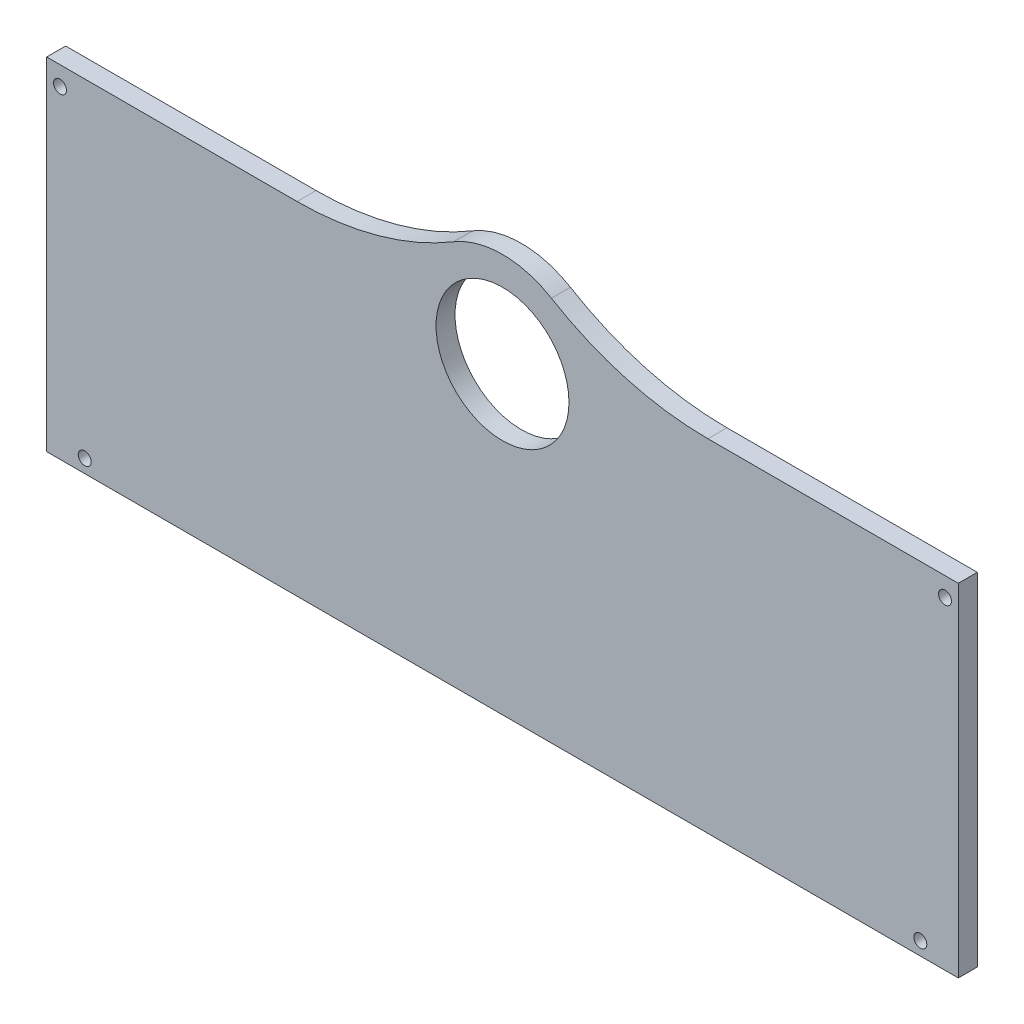
ISO-10303-21;
HEADER;
FILE_DESCRIPTION(('STEP AP214'),'2;1');
FILE_NAME('part.step','',(''),(''),'','','');
FILE_SCHEMA(('AUTOMOTIVE_DESIGN { 1 0 10303 214 1 1 1 1 }'));
ENDSEC;
DATA;
#1=APPLICATION_CONTEXT('core data for automotive mechanical design processes');
#2=APPLICATION_PROTOCOL_DEFINITION('international standard','automotive_design',2000,#1);
#3=PRODUCT_CONTEXT('',#1,'mechanical');
#4=PRODUCT('Part','Part','',(#3));
#5=PRODUCT_RELATED_PRODUCT_CATEGORY('part','',(#4));
#6=PRODUCT_DEFINITION_FORMATION('','',#4);
#7=PRODUCT_DEFINITION_CONTEXT('part definition',#1,'design');
#8=PRODUCT_DEFINITION('design','',#6,#7);
#9=PRODUCT_DEFINITION_SHAPE('','',#8);
#10=(LENGTH_UNIT() NAMED_UNIT(*) SI_UNIT(.MILLI.,.METRE.));
#11=(NAMED_UNIT(*) PLANE_ANGLE_UNIT() SI_UNIT($,.RADIAN.));
#12=(NAMED_UNIT(*) SI_UNIT($,.STERADIAN.) SOLID_ANGLE_UNIT());
#13=UNCERTAINTY_MEASURE_WITH_UNIT(LENGTH_MEASURE(1.E-05),#10,'distance_accuracy_value','');
#14=(GEOMETRIC_REPRESENTATION_CONTEXT(3) GLOBAL_UNCERTAINTY_ASSIGNED_CONTEXT((#13)) GLOBAL_UNIT_ASSIGNED_CONTEXT((#10,
#11,#12)) REPRESENTATION_CONTEXT('',''));
#15=CARTESIAN_POINT('',(0.,0.,0.));
#16=DIRECTION('',(0.,0.,1.));
#17=DIRECTION('',(1.,0.,0.));
#18=AXIS2_PLACEMENT_3D('',#15,#16,#17);
#19=CARTESIAN_POINT('',(-68.685751797589,114.3,6.35));
#20=DIRECTION('',(0.,0.,1.));
#21=DIRECTION('',(1.,0.,0.));
#22=AXIS2_PLACEMENT_3D('',#19,#20,#21);
#23=PLANE('',#22);
#24=CARTESIAN_POINT('',(139.7,-97.155,6.35));
#25=DIRECTION('',(0.,0.,1.));
#26=DIRECTION('',(1.,0.,0.));
#27=AXIS2_PLACEMENT_3D('',#24,#25,#26);
#28=CIRCLE('',#27,2.15899999999999);
#29=CARTESIAN_POINT('',(141.859,-97.155,6.35));
#30=VERTEX_POINT('',#29);
#31=EDGE_CURVE('E227',#30,#30,#28,.T.);
#32=ORIENTED_EDGE('',*,*,#31,.F.);
#33=EDGE_LOOP('',(#32));
#34=FACE_BOUND('',#33,.T.);
#35=CARTESIAN_POINT('',(147.955,6.34999999999999,6.35));
#36=DIRECTION('',(0.,0.,1.));
#37=DIRECTION('',(1.,0.,0.));
#38=AXIS2_PLACEMENT_3D('',#35,#36,#37);
#39=CIRCLE('',#38,2.15899999999999);
#40=CARTESIAN_POINT('',(150.114,6.34999999999999,6.35));
#41=VERTEX_POINT('',#40);
#42=EDGE_CURVE('E235',#41,#41,#39,.T.);
#43=ORIENTED_EDGE('',*,*,#42,.F.);
#44=EDGE_LOOP('',(#43));
#45=FACE_BOUND('',#44,.T.);
#46=CARTESIAN_POINT('',(-147.955,6.34999999999999,6.35));
#47=DIRECTION('',(0.,0.,1.));
#48=DIRECTION('',(1.,0.,0.));
#49=AXIS2_PLACEMENT_3D('',#46,#47,#48);
#50=CIRCLE('',#49,2.15899999999999);
#51=CARTESIAN_POINT('',(-145.796,6.34999999999999,6.35));
#52=VERTEX_POINT('',#51);
#53=EDGE_CURVE('E243',#52,#52,#50,.T.);
#54=ORIENTED_EDGE('',*,*,#53,.F.);
#55=EDGE_LOOP('',(#54));
#56=FACE_BOUND('',#55,.T.);
#57=CARTESIAN_POINT('',(-139.7,-97.155,6.35));
#58=DIRECTION('',(0.,0.,1.));
#59=DIRECTION('',(1.,0.,0.));
#60=AXIS2_PLACEMENT_3D('',#57,#58,#59);
#61=CIRCLE('',#60,2.15899999999999);
#62=CARTESIAN_POINT('',(-137.541,-97.155,6.35));
#63=VERTEX_POINT('',#62);
#64=EDGE_CURVE('E219',#63,#63,#61,.T.);
#65=ORIENTED_EDGE('',*,*,#64,.F.);
#66=EDGE_LOOP('',(#65));
#67=FACE_BOUND('',#66,.T.);
#68=DIRECTION('',(0.,-1.,0.));
#69=VECTOR('',#68,1.);
#70=CARTESIAN_POINT('',(-152.4,-101.6,6.35));
#71=LINE('',#70,#69);
#72=CARTESIAN_POINT('',(-152.4,12.7,6.35));
#73=VERTEX_POINT('',#72);
#74=CARTESIAN_POINT('',(-152.4,-101.6,6.35));
#75=VERTEX_POINT('',#74);
#76=EDGE_CURVE('E166',#73,#75,#71,.T.);
#77=ORIENTED_EDGE('',*,*,#76,.T.);
#78=DIRECTION('',(1.,0.,0.));
#79=VECTOR('',#78,1.);
#80=CARTESIAN_POINT('',(-152.4,-101.6,6.35));
#81=LINE('',#80,#79);
#82=CARTESIAN_POINT('',(152.4,-101.6,6.35));
#83=VERTEX_POINT('',#82);
#84=EDGE_CURVE('E102',#75,#83,#81,.T.);
#85=ORIENTED_EDGE('',*,*,#84,.T.);
#86=DIRECTION('',(0.,1.,0.));
#87=VECTOR('',#86,1.);
#88=CARTESIAN_POINT('',(152.4,-101.6,6.35));
#89=LINE('',#88,#87);
#90=CARTESIAN_POINT('',(152.4,12.7,6.35));
#91=VERTEX_POINT('',#90);
#92=EDGE_CURVE('E187',#83,#91,#89,.T.);
#93=ORIENTED_EDGE('',*,*,#92,.T.);
#94=DIRECTION('',(-1.,0.,0.));
#95=VECTOR('',#94,1.);
#96=CARTESIAN_POINT('',(152.4,12.7,6.35));
#97=LINE('',#96,#95);
#98=CARTESIAN_POINT('',(68.685751797589,12.7,6.35));
#99=VERTEX_POINT('',#98);
#100=EDGE_CURVE('E201',#91,#99,#97,.T.);
#101=ORIENTED_EDGE('',*,*,#100,.T.);
#102=CARTESIAN_POINT('',(68.685751797589,114.3,6.35));
#103=DIRECTION('',(0.,0.,-1.));
#104=DIRECTION('',(-1.,0.,0.));
#105=AXIS2_PLACEMENT_3D('',#102,#103,#104);
#106=CIRCLE('',#105,101.6);
#107=CARTESIAN_POINT('',(16.3537504279974,27.2142857142857,6.35));
#108=VERTEX_POINT('',#107);
#109=EDGE_CURVE('E121',#99,#108,#106,.T.);
#110=ORIENTED_EDGE('',*,*,#109,.T.);
#111=CARTESIAN_POINT('',(0.,0.,6.35));
#112=DIRECTION('',(0.,0.,1.));
#113=DIRECTION('',(-1.,0.,0.));
#114=AXIS2_PLACEMENT_3D('',#111,#112,#113);
#115=CIRCLE('',#114,31.75);
#116=CARTESIAN_POINT('',(-16.3537504279974,27.2142857142857,6.35));
#117=VERTEX_POINT('',#116);
#118=EDGE_CURVE('E115',#108,#117,#115,.T.);
#119=ORIENTED_EDGE('',*,*,#118,.T.);
#120=CARTESIAN_POINT('',(-68.685751797589,114.3,6.35));
#121=DIRECTION('',(0.,0.,-1.));
#122=DIRECTION('',(1.,0.,0.));
#123=AXIS2_PLACEMENT_3D('',#120,#121,#122);
#124=CIRCLE('',#123,101.6);
#125=CARTESIAN_POINT('',(-68.685751797589,12.7,6.35));
#126=VERTEX_POINT('',#125);
#127=EDGE_CURVE('E119',#117,#126,#124,.T.);
#128=ORIENTED_EDGE('',*,*,#127,.T.);
#129=DIRECTION('',(-1.,0.,0.));
#130=VECTOR('',#129,1.);
#131=CARTESIAN_POINT('',(-152.4,12.7,6.35));
#132=LINE('',#131,#130);
#133=EDGE_CURVE('E59',#126,#73,#132,.T.);
#134=ORIENTED_EDGE('',*,*,#133,.T.);
#135=EDGE_LOOP('',(#77,#85,#93,#101,#110,#119,#128,#134));
#136=FACE_BOUND('',#135,.T.);
#137=CARTESIAN_POINT('',(0.,0.,6.35));
#138=DIRECTION('',(0.,0.,1.));
#139=DIRECTION('',(1.,0.,0.));
#140=AXIS2_PLACEMENT_3D('',#137,#138,#139);
#141=CIRCLE('',#140,22.225);
#142=CARTESIAN_POINT('',(22.225,0.,6.35));
#143=VERTEX_POINT('',#142);
#144=EDGE_CURVE('E148',#143,#143,#141,.T.);
#145=ORIENTED_EDGE('',*,*,#144,.F.);
#146=EDGE_LOOP('',(#145));
#147=FACE_BOUND('',#146,.T.);
#148=ADVANCED_FACE('F41',(#34,#45,#56,#67,#136,#147),#23,.T.);
#149=CARTESIAN_POINT('',(-68.685751797589,114.3,0.));
#150=DIRECTION('',(0.,0.,1.));
#151=DIRECTION('',(1.,0.,0.));
#152=AXIS2_PLACEMENT_3D('',#149,#150,#151);
#153=PLANE('',#152);
#154=CARTESIAN_POINT('',(139.7,-97.155,0.));
#155=DIRECTION('',(0.,0.,1.));
#156=DIRECTION('',(1.,0.,0.));
#157=AXIS2_PLACEMENT_3D('',#154,#155,#156);
#158=CIRCLE('',#157,2.15899999999999);
#159=CARTESIAN_POINT('',(141.859,-97.155,0.));
#160=VERTEX_POINT('',#159);
#161=EDGE_CURVE('E231',#160,#160,#158,.T.);
#162=ORIENTED_EDGE('',*,*,#161,.T.);
#163=EDGE_LOOP('',(#162));
#164=FACE_BOUND('',#163,.T.);
#165=CARTESIAN_POINT('',(147.955,6.34999999999999,0.));
#166=DIRECTION('',(0.,0.,1.));
#167=DIRECTION('',(1.,0.,0.));
#168=AXIS2_PLACEMENT_3D('',#165,#166,#167);
#169=CIRCLE('',#168,2.15899999999999);
#170=CARTESIAN_POINT('',(150.114,6.34999999999999,0.));
#171=VERTEX_POINT('',#170);
#172=EDGE_CURVE('E239',#171,#171,#169,.T.);
#173=ORIENTED_EDGE('',*,*,#172,.T.);
#174=EDGE_LOOP('',(#173));
#175=FACE_BOUND('',#174,.T.);
#176=CARTESIAN_POINT('',(-147.955,6.34999999999999,0.));
#177=DIRECTION('',(0.,0.,1.));
#178=DIRECTION('',(1.,0.,0.));
#179=AXIS2_PLACEMENT_3D('',#176,#177,#178);
#180=CIRCLE('',#179,2.15899999999999);
#181=CARTESIAN_POINT('',(-145.796,6.34999999999999,0.));
#182=VERTEX_POINT('',#181);
#183=EDGE_CURVE('E223',#182,#182,#180,.T.);
#184=ORIENTED_EDGE('',*,*,#183,.T.);
#185=EDGE_LOOP('',(#184));
#186=FACE_BOUND('',#185,.T.);
#187=CARTESIAN_POINT('',(-139.7,-97.155,0.));
#188=DIRECTION('',(0.,0.,1.));
#189=DIRECTION('',(1.,0.,0.));
#190=AXIS2_PLACEMENT_3D('',#187,#188,#189);
#191=CIRCLE('',#190,2.15899999999999);
#192=CARTESIAN_POINT('',(-137.541,-97.155,0.));
#193=VERTEX_POINT('',#192);
#194=EDGE_CURVE('E215',#193,#193,#191,.T.);
#195=ORIENTED_EDGE('',*,*,#194,.T.);
#196=EDGE_LOOP('',(#195));
#197=FACE_BOUND('',#196,.T.);
#198=DIRECTION('',(0.,-1.,0.));
#199=VECTOR('',#198,1.);
#200=CARTESIAN_POINT('',(-152.4,-101.6,0.));
#201=LINE('',#200,#199);
#202=CARTESIAN_POINT('',(-152.4,12.7,0.));
#203=VERTEX_POINT('',#202);
#204=CARTESIAN_POINT('',(-152.4,-101.6,0.));
#205=VERTEX_POINT('',#204);
#206=EDGE_CURVE('E143',#203,#205,#201,.T.);
#207=ORIENTED_EDGE('',*,*,#206,.F.);
#208=DIRECTION('',(-1.,0.,0.));
#209=VECTOR('',#208,1.);
#210=CARTESIAN_POINT('',(-152.4,12.7,0.));
#211=LINE('',#210,#209);
#212=CARTESIAN_POINT('',(-68.685751797589,12.7,0.));
#213=VERTEX_POINT('',#212);
#214=EDGE_CURVE('E94',#213,#203,#211,.T.);
#215=ORIENTED_EDGE('',*,*,#214,.F.);
#216=CARTESIAN_POINT('',(-68.685751797589,114.3,0.));
#217=DIRECTION('',(0.,0.,-1.));
#218=DIRECTION('',(1.,0.,0.));
#219=AXIS2_PLACEMENT_3D('',#216,#217,#218);
#220=CIRCLE('',#219,101.6);
#221=CARTESIAN_POINT('',(-16.3537504279974,27.2142857142857,0.));
#222=VERTEX_POINT('',#221);
#223=EDGE_CURVE('E88',#222,#213,#220,.T.);
#224=ORIENTED_EDGE('',*,*,#223,.F.);
#225=CARTESIAN_POINT('',(0.,0.,0.));
#226=DIRECTION('',(0.,0.,1.));
#227=DIRECTION('',(-1.,0.,0.));
#228=AXIS2_PLACEMENT_3D('',#225,#226,#227);
#229=CIRCLE('',#228,31.75);
#230=CARTESIAN_POINT('',(16.3537504279974,27.2142857142857,0.));
#231=VERTEX_POINT('',#230);
#232=EDGE_CURVE('E130',#231,#222,#229,.T.);
#233=ORIENTED_EDGE('',*,*,#232,.F.);
#234=CARTESIAN_POINT('',(68.685751797589,114.3,0.));
#235=DIRECTION('',(0.,0.,-1.));
#236=DIRECTION('',(-1.,0.,0.));
#237=AXIS2_PLACEMENT_3D('',#234,#235,#236);
#238=CIRCLE('',#237,101.6);
#239=CARTESIAN_POINT('',(68.685751797589,12.7,0.));
#240=VERTEX_POINT('',#239);
#241=EDGE_CURVE('E157',#240,#231,#238,.T.);
#242=ORIENTED_EDGE('',*,*,#241,.F.);
#243=DIRECTION('',(-1.,0.,0.));
#244=VECTOR('',#243,1.);
#245=CARTESIAN_POINT('',(152.4,12.7,0.));
#246=LINE('',#245,#244);
#247=CARTESIAN_POINT('',(152.4,12.7,0.));
#248=VERTEX_POINT('',#247);
#249=EDGE_CURVE('E154',#248,#240,#246,.T.);
#250=ORIENTED_EDGE('',*,*,#249,.F.);
#251=DIRECTION('',(0.,1.,0.));
#252=VECTOR('',#251,1.);
#253=CARTESIAN_POINT('',(152.4,-101.6,0.));
#254=LINE('',#253,#252);
#255=CARTESIAN_POINT('',(152.4,-101.6,0.));
#256=VERTEX_POINT('',#255);
#257=EDGE_CURVE('E151',#256,#248,#254,.T.);
#258=ORIENTED_EDGE('',*,*,#257,.F.);
#259=DIRECTION('',(1.,0.,0.));
#260=VECTOR('',#259,1.);
#261=CARTESIAN_POINT('',(-152.4,-101.6,0.));
#262=LINE('',#261,#260);
#263=EDGE_CURVE('E147',#205,#256,#262,.T.);
#264=ORIENTED_EDGE('',*,*,#263,.F.);
#265=EDGE_LOOP('',(#207,#215,#224,#233,#242,#250,#258,#264));
#266=FACE_BOUND('',#265,.T.);
#267=CARTESIAN_POINT('',(0.,0.,0.));
#268=DIRECTION('',(0.,0.,1.));
#269=DIRECTION('',(1.,0.,0.));
#270=AXIS2_PLACEMENT_3D('',#267,#268,#269);
#271=CIRCLE('',#270,22.225);
#272=CARTESIAN_POINT('',(22.225,0.,0.));
#273=VERTEX_POINT('',#272);
#274=EDGE_CURVE('E211',#273,#273,#271,.T.);
#275=ORIENTED_EDGE('',*,*,#274,.T.);
#276=EDGE_LOOP('',(#275));
#277=FACE_BOUND('',#276,.T.);
#278=ADVANCED_FACE('F191',(#164,#175,#186,#197,#266,#277),#153,.F.);
#279=CARTESIAN_POINT('',(-152.4,-101.6,6.35));
#280=DIRECTION('',(1.,0.,0.));
#281=DIRECTION('',(0.,0.,-1.));
#282=AXIS2_PLACEMENT_3D('',#279,#280,#281);
#283=PLANE('',#282);
#284=ORIENTED_EDGE('',*,*,#206,.T.);
#285=DIRECTION('',(0.,0.,-1.));
#286=VECTOR('',#285,1.);
#287=CARTESIAN_POINT('',(-152.4,-101.6,6.35));
#288=LINE('',#287,#286);
#289=EDGE_CURVE('E11',#75,#205,#288,.T.);
#290=ORIENTED_EDGE('',*,*,#289,.F.);
#291=ORIENTED_EDGE('',*,*,#76,.F.);
#292=DIRECTION('',(0.,0.,-1.));
#293=VECTOR('',#292,1.);
#294=CARTESIAN_POINT('',(-152.4,12.7,6.35));
#295=LINE('',#294,#293);
#296=EDGE_CURVE('E139',#73,#203,#295,.T.);
#297=ORIENTED_EDGE('',*,*,#296,.T.);
#298=EDGE_LOOP('',(#284,#290,#291,#297));
#299=FACE_BOUND('',#298,.T.);
#300=ADVANCED_FACE('F43',(#299),#283,.F.);
#301=CARTESIAN_POINT('',(-152.4,-101.6,6.35));
#302=DIRECTION('',(0.,1.,0.));
#303=DIRECTION('',(0.,0.,1.));
#304=AXIS2_PLACEMENT_3D('',#301,#302,#303);
#305=PLANE('',#304);
#306=ORIENTED_EDGE('',*,*,#263,.T.);
#307=DIRECTION('',(0.,0.,-1.));
#308=VECTOR('',#307,1.);
#309=CARTESIAN_POINT('',(152.4,-101.6,6.35));
#310=LINE('',#309,#308);
#311=EDGE_CURVE('E51',#83,#256,#310,.T.);
#312=ORIENTED_EDGE('',*,*,#311,.F.);
#313=ORIENTED_EDGE('',*,*,#84,.F.);
#314=ORIENTED_EDGE('',*,*,#289,.T.);
#315=EDGE_LOOP('',(#306,#312,#313,#314));
#316=FACE_BOUND('',#315,.T.);
#317=ADVANCED_FACE('F296',(#316),#305,.F.);
#318=CARTESIAN_POINT('',(152.4,-101.6,6.35));
#319=DIRECTION('',(-1.,0.,0.));
#320=DIRECTION('',(0.,0.,1.));
#321=AXIS2_PLACEMENT_3D('',#318,#319,#320);
#322=PLANE('',#321);
#323=ORIENTED_EDGE('',*,*,#257,.T.);
#324=DIRECTION('',(0.,0.,-1.));
#325=VECTOR('',#324,1.);
#326=CARTESIAN_POINT('',(152.4,12.7,6.35));
#327=LINE('',#326,#325);
#328=EDGE_CURVE('E177',#91,#248,#327,.T.);
#329=ORIENTED_EDGE('',*,*,#328,.F.);
#330=ORIENTED_EDGE('',*,*,#92,.F.);
#331=ORIENTED_EDGE('',*,*,#311,.T.);
#332=EDGE_LOOP('',(#323,#329,#330,#331));
#333=FACE_BOUND('',#332,.T.);
#334=ADVANCED_FACE('F185',(#333),#322,.F.);
#335=CARTESIAN_POINT('',(152.4,12.7,6.35));
#336=DIRECTION('',(0.,-1.,0.));
#337=DIRECTION('',(1.,0.,0.));
#338=AXIS2_PLACEMENT_3D('',#335,#336,#337);
#339=PLANE('',#338);
#340=ORIENTED_EDGE('',*,*,#249,.T.);
#341=DIRECTION('',(0.,0.,-1.));
#342=VECTOR('',#341,1.);
#343=CARTESIAN_POINT('',(68.685751797589,12.7,6.35));
#344=LINE('',#343,#342);
#345=EDGE_CURVE('E173',#99,#240,#344,.T.);
#346=ORIENTED_EDGE('',*,*,#345,.F.);
#347=ORIENTED_EDGE('',*,*,#100,.F.);
#348=ORIENTED_EDGE('',*,*,#328,.T.);
#349=EDGE_LOOP('',(#340,#346,#347,#348));
#350=FACE_BOUND('',#349,.T.);
#351=ADVANCED_FACE('F196',(#350),#339,.F.);
#352=CARTESIAN_POINT('',(68.685751797589,114.3,6.35));
#353=DIRECTION('',(0.,0.,-1.));
#354=DIRECTION('',(-1.,0.,0.));
#355=AXIS2_PLACEMENT_3D('',#352,#353,#354);
#356=CYLINDRICAL_SURFACE('',#355,101.6);
#357=ORIENTED_EDGE('',*,*,#241,.T.);
#358=DIRECTION('',(0.,0.,-1.));
#359=VECTOR('',#358,1.);
#360=CARTESIAN_POINT('',(16.3537504279974,27.2142857142857,6.35));
#361=LINE('',#360,#359);
#362=EDGE_CURVE('E132',#108,#231,#361,.T.);
#363=ORIENTED_EDGE('',*,*,#362,.F.);
#364=ORIENTED_EDGE('',*,*,#109,.F.);
#365=ORIENTED_EDGE('',*,*,#345,.T.);
#366=EDGE_LOOP('',(#357,#363,#364,#365));
#367=FACE_BOUND('',#366,.T.);
#368=ADVANCED_FACE('F199',(#367),#356,.F.);
#369=CARTESIAN_POINT('',(0.,0.,6.35));
#370=DIRECTION('',(0.,0.,-1.));
#371=DIRECTION('',(-1.,0.,0.));
#372=AXIS2_PLACEMENT_3D('',#369,#370,#371);
#373=CYLINDRICAL_SURFACE('',#372,31.75);
#374=ORIENTED_EDGE('',*,*,#232,.T.);
#375=DIRECTION('',(0.,0.,-1.));
#376=VECTOR('',#375,1.);
#377=CARTESIAN_POINT('',(-16.3537504279974,27.2142857142857,6.35));
#378=LINE('',#377,#376);
#379=EDGE_CURVE('E127',#117,#222,#378,.T.);
#380=ORIENTED_EDGE('',*,*,#379,.F.);
#381=ORIENTED_EDGE('',*,*,#118,.F.);
#382=ORIENTED_EDGE('',*,*,#362,.T.);
#383=EDGE_LOOP('',(#374,#380,#381,#382));
#384=FACE_BOUND('',#383,.T.);
#385=ADVANCED_FACE('F128',(#384),#373,.T.);
#386=CARTESIAN_POINT('',(-68.685751797589,114.3,6.35));
#387=DIRECTION('',(0.,0.,-1.));
#388=DIRECTION('',(-1.,0.,0.));
#389=AXIS2_PLACEMENT_3D('',#386,#387,#388);
#390=CYLINDRICAL_SURFACE('',#389,101.6);
#391=ORIENTED_EDGE('',*,*,#223,.T.);
#392=DIRECTION('',(0.,0.,-1.));
#393=VECTOR('',#392,1.);
#394=CARTESIAN_POINT('',(-68.685751797589,12.7,6.35));
#395=LINE('',#394,#393);
#396=EDGE_CURVE('E133',#126,#213,#395,.T.);
#397=ORIENTED_EDGE('',*,*,#396,.F.);
#398=ORIENTED_EDGE('',*,*,#127,.F.);
#399=ORIENTED_EDGE('',*,*,#379,.T.);
#400=EDGE_LOOP('',(#391,#397,#398,#399));
#401=FACE_BOUND('',#400,.T.);
#402=ADVANCED_FACE('F135',(#401),#390,.F.);
#403=CARTESIAN_POINT('',(-152.4,12.7,6.35));
#404=DIRECTION('',(0.,-1.,0.));
#405=DIRECTION('',(1.,0.,0.));
#406=AXIS2_PLACEMENT_3D('',#403,#404,#405);
#407=PLANE('',#406);
#408=ORIENTED_EDGE('',*,*,#214,.T.);
#409=ORIENTED_EDGE('',*,*,#296,.F.);
#410=ORIENTED_EDGE('',*,*,#133,.F.);
#411=ORIENTED_EDGE('',*,*,#396,.T.);
#412=EDGE_LOOP('',(#408,#409,#410,#411));
#413=FACE_BOUND('',#412,.T.);
#414=ADVANCED_FACE('F274',(#413),#407,.F.);
#415=CARTESIAN_POINT('',(0.,0.,6.35));
#416=DIRECTION('',(0.,0.,-1.));
#417=DIRECTION('',(-1.,0.,0.));
#418=AXIS2_PLACEMENT_3D('',#415,#416,#417);
#419=CYLINDRICAL_SURFACE('',#418,22.225);
#420=ORIENTED_EDGE('',*,*,#144,.T.);
#421=EDGE_LOOP('',(#420));
#422=FACE_BOUND('',#421,.T.);
#423=ORIENTED_EDGE('',*,*,#274,.F.);
#424=EDGE_LOOP('',(#423));
#425=FACE_BOUND('',#424,.T.);
#426=ADVANCED_FACE('F268',(#422,#425),#419,.F.);
#427=CARTESIAN_POINT('',(-139.7,-97.155,0.));
#428=DIRECTION('',(0.,0.,1.));
#429=DIRECTION('',(1.,0.,0.));
#430=AXIS2_PLACEMENT_3D('',#427,#428,#429);
#431=CYLINDRICAL_SURFACE('',#430,2.15899999999999);
#432=ORIENTED_EDGE('',*,*,#194,.F.);
#433=EDGE_LOOP('',(#432));
#434=FACE_BOUND('',#433,.T.);
#435=ORIENTED_EDGE('',*,*,#64,.T.);
#436=EDGE_LOOP('',(#435));
#437=FACE_BOUND('',#436,.T.);
#438=ADVANCED_FACE('F257',(#434,#437),#431,.F.);
#439=CARTESIAN_POINT('',(-147.955,6.34999999999999,0.));
#440=DIRECTION('',(0.,0.,1.));
#441=DIRECTION('',(1.,0.,0.));
#442=AXIS2_PLACEMENT_3D('',#439,#440,#441);
#443=CYLINDRICAL_SURFACE('',#442,2.15899999999999);
#444=ORIENTED_EDGE('',*,*,#183,.F.);
#445=EDGE_LOOP('',(#444));
#446=FACE_BOUND('',#445,.T.);
#447=ORIENTED_EDGE('',*,*,#53,.T.);
#448=EDGE_LOOP('',(#447));
#449=FACE_BOUND('',#448,.T.);
#450=ADVANCED_FACE('F253',(#446,#449),#443,.F.);
#451=CARTESIAN_POINT('',(147.955,6.34999999999999,0.));
#452=DIRECTION('',(0.,0.,1.));
#453=DIRECTION('',(1.,0.,0.));
#454=AXIS2_PLACEMENT_3D('',#451,#452,#453);
#455=CYLINDRICAL_SURFACE('',#454,2.15899999999999);
#456=ORIENTED_EDGE('',*,*,#172,.F.);
#457=EDGE_LOOP('',(#456));
#458=FACE_BOUND('',#457,.T.);
#459=ORIENTED_EDGE('',*,*,#42,.T.);
#460=EDGE_LOOP('',(#459));
#461=FACE_BOUND('',#460,.T.);
#462=ADVANCED_FACE('F256',(#458,#461),#455,.F.);
#463=CARTESIAN_POINT('',(139.7,-97.155,0.));
#464=DIRECTION('',(0.,0.,1.));
#465=DIRECTION('',(1.,0.,0.));
#466=AXIS2_PLACEMENT_3D('',#463,#464,#465);
#467=CYLINDRICAL_SURFACE('',#466,2.15899999999999);
#468=ORIENTED_EDGE('',*,*,#161,.F.);
#469=EDGE_LOOP('',(#468));
#470=FACE_BOUND('',#469,.T.);
#471=ORIENTED_EDGE('',*,*,#31,.T.);
#472=EDGE_LOOP('',(#471));
#473=FACE_BOUND('',#472,.T.);
#474=ADVANCED_FACE('F279',(#470,#473),#467,.F.);
#475=CLOSED_SHELL('',(#148,#278,#300,#317,#334,#351,#368,#385,#402,#414,#426,#438,#450,#462,#474));
#476=MANIFOLD_SOLID_BREP('B2',#475);
#477=ADVANCED_BREP_SHAPE_REPRESENTATION('',(#18,#476),#14);
#478=SHAPE_DEFINITION_REPRESENTATION(#9,#477);
ENDSEC;
END-ISO-10303-21;
